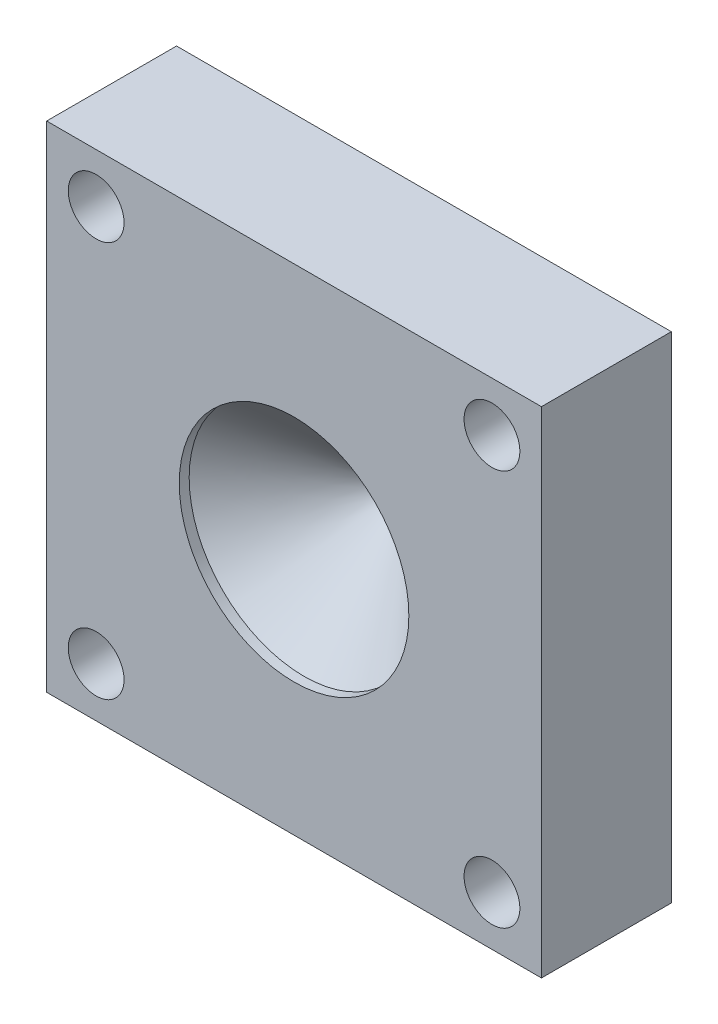
ISO-10303-21;
HEADER;
FILE_DESCRIPTION(('STEP AP214'),'2;1');
FILE_NAME('part.step','',(''),(''),'','','');
FILE_SCHEMA(('AUTOMOTIVE_DESIGN { 1 0 10303 214 1 1 1 1 }'));
ENDSEC;
DATA;
#1=APPLICATION_CONTEXT('core data for automotive mechanical design processes');
#2=APPLICATION_PROTOCOL_DEFINITION('international standard','automotive_design',2000,#1);
#3=PRODUCT_CONTEXT('',#1,'mechanical');
#4=PRODUCT('Part','Part','',(#3));
#5=PRODUCT_RELATED_PRODUCT_CATEGORY('part','',(#4));
#6=PRODUCT_DEFINITION_FORMATION('','',#4);
#7=PRODUCT_DEFINITION_CONTEXT('part definition',#1,'design');
#8=PRODUCT_DEFINITION('design','',#6,#7);
#9=PRODUCT_DEFINITION_SHAPE('','',#8);
#10=(LENGTH_UNIT() NAMED_UNIT(*) SI_UNIT(.MILLI.,.METRE.));
#11=(NAMED_UNIT(*) PLANE_ANGLE_UNIT() SI_UNIT($,.RADIAN.));
#12=(NAMED_UNIT(*) SI_UNIT($,.STERADIAN.) SOLID_ANGLE_UNIT());
#13=UNCERTAINTY_MEASURE_WITH_UNIT(LENGTH_MEASURE(1.E-05),#10,'distance_accuracy_value','');
#14=(GEOMETRIC_REPRESENTATION_CONTEXT(3) GLOBAL_UNCERTAINTY_ASSIGNED_CONTEXT((#13)) GLOBAL_UNIT_ASSIGNED_CONTEXT((#10,
#11,#12)) REPRESENTATION_CONTEXT('',''));
#15=CARTESIAN_POINT('',(0.,0.,0.));
#16=DIRECTION('',(0.,0.,1.));
#17=DIRECTION('',(1.,0.,0.));
#18=AXIS2_PLACEMENT_3D('',#15,#16,#17);
#19=CARTESIAN_POINT('',(0.,0.,16.66875));
#20=DIRECTION('',(0.,0.,-1.));
#21=DIRECTION('',(-1.,0.,0.));
#22=AXIS2_PLACEMENT_3D('',#19,#20,#21);
#23=CYLINDRICAL_SURFACE('',#22,0.79375);
#24=CARTESIAN_POINT('',(0.,0.,0.));
#25=DIRECTION('',(0.,0.,1.));
#26=DIRECTION('',(1.,0.,0.));
#27=AXIS2_PLACEMENT_3D('',#24,#25,#26);
#28=CIRCLE('',#27,0.79375);
#29=CARTESIAN_POINT('',(0.79375,0.,0.));
#30=VERTEX_POINT('',#29);
#31=EDGE_CURVE('E103',#30,#30,#28,.T.);
#32=ORIENTED_EDGE('',*,*,#31,.F.);
#33=EDGE_LOOP('',(#32));
#34=FACE_BOUND('',#33,.T.);
#35=CARTESIAN_POINT('',(0.,0.,2.69875));
#36=DIRECTION('',(0.,0.,1.));
#37=DIRECTION('',(1.,0.,0.));
#38=AXIS2_PLACEMENT_3D('',#35,#36,#37);
#39=CIRCLE('',#38,0.79375);
#40=CARTESIAN_POINT('',(0.79375,0.,2.69875));
#41=VERTEX_POINT('',#40);
#42=EDGE_CURVE('E37',#41,#41,#39,.T.);
#43=ORIENTED_EDGE('',*,*,#42,.T.);
#44=EDGE_LOOP('',(#43));
#45=FACE_BOUND('',#44,.T.);
#46=ADVANCED_FACE('F33',(#34,#45),#23,.F.);
#47=CARTESIAN_POINT('',(0.,0.,16.66875));
#48=DIRECTION('',(0.,0.,1.));
#49=DIRECTION('',(1.,0.,0.));
#50=AXIS2_PLACEMENT_3D('',#47,#48,#49);
#51=PLANE('',#50);
#52=CARTESIAN_POINT('',(0.,0.,16.66875));
#53=DIRECTION('',(0.,0.,1.));
#54=DIRECTION('',(1.,0.,0.));
#55=AXIS2_PLACEMENT_3D('',#52,#53,#54);
#56=CIRCLE('',#55,14.732);
#57=CARTESIAN_POINT('',(14.732,0.,16.66875));
#58=VERTEX_POINT('',#57);
#59=EDGE_CURVE('E139',#58,#58,#56,.T.);
#60=ORIENTED_EDGE('',*,*,#59,.F.);
#61=EDGE_LOOP('',(#60));
#62=FACE_BOUND('',#61,.T.);
#63=CARTESIAN_POINT('',(25.4000000000014,-25.3999999999986,16.66875));
#64=DIRECTION('',(0.,0.,1.));
#65=DIRECTION('',(1.,0.,0.));
#66=AXIS2_PLACEMENT_3D('',#63,#64,#65);
#67=CIRCLE('',#66,3.58140000000201);
#68=CARTESIAN_POINT('',(28.9814000000035,-25.3999999999986,16.66875));
#69=VERTEX_POINT('',#68);
#70=EDGE_CURVE('E127',#69,#69,#67,.T.);
#71=ORIENTED_EDGE('',*,*,#70,.F.);
#72=EDGE_LOOP('',(#71));
#73=FACE_BOUND('',#72,.T.);
#74=CARTESIAN_POINT('',(-25.4,25.4,16.66875));
#75=DIRECTION('',(0.,0.,1.));
#76=DIRECTION('',(1.,0.,0.));
#77=AXIS2_PLACEMENT_3D('',#74,#75,#76);
#78=CIRCLE('',#77,3.5814);
#79=CARTESIAN_POINT('',(-21.8186,25.4,16.66875));
#80=VERTEX_POINT('',#79);
#81=EDGE_CURVE('E117',#80,#80,#78,.T.);
#82=ORIENTED_EDGE('',*,*,#81,.F.);
#83=EDGE_LOOP('',(#82));
#84=FACE_BOUND('',#83,.T.);
#85=DIRECTION('',(0.,-1.,0.));
#86=VECTOR('',#85,1.);
#87=CARTESIAN_POINT('',(-31.75,-31.75,16.66875));
#88=LINE('',#87,#86);
#89=CARTESIAN_POINT('',(-31.75,31.75,16.66875));
#90=VERTEX_POINT('',#89);
#91=CARTESIAN_POINT('',(-31.75,-31.75,16.66875));
#92=VERTEX_POINT('',#91);
#93=EDGE_CURVE('E87',#90,#92,#88,.T.);
#94=ORIENTED_EDGE('',*,*,#93,.T.);
#95=DIRECTION('',(1.,0.,0.));
#96=VECTOR('',#95,1.);
#97=CARTESIAN_POINT('',(31.75,-31.75,16.66875));
#98=LINE('',#97,#96);
#99=CARTESIAN_POINT('',(31.75,-31.75,16.66875));
#100=VERTEX_POINT('',#99);
#101=EDGE_CURVE('E81',#92,#100,#98,.T.);
#102=ORIENTED_EDGE('',*,*,#101,.T.);
#103=DIRECTION('',(0.,1.,0.));
#104=VECTOR('',#103,1.);
#105=CARTESIAN_POINT('',(31.75,-31.75,16.66875));
#106=LINE('',#105,#104);
#107=CARTESIAN_POINT('',(31.75,31.75,16.66875));
#108=VERTEX_POINT('',#107);
#109=EDGE_CURVE('E85',#100,#108,#106,.T.);
#110=ORIENTED_EDGE('',*,*,#109,.T.);
#111=DIRECTION('',(-1.,0.,0.));
#112=VECTOR('',#111,1.);
#113=CARTESIAN_POINT('',(31.75,31.75,16.66875));
#114=LINE('',#113,#112);
#115=EDGE_CURVE('E51',#108,#90,#114,.T.);
#116=ORIENTED_EDGE('',*,*,#115,.T.);
#117=EDGE_LOOP('',(#94,#102,#110,#116));
#118=FACE_BOUND('',#117,.T.);
#119=CARTESIAN_POINT('',(25.4,25.4000000000014,16.66875));
#120=DIRECTION('',(0.,0.,1.));
#121=DIRECTION('',(1.,0.,0.));
#122=AXIS2_PLACEMENT_3D('',#119,#120,#121);
#123=CIRCLE('',#122,3.58140000000148);
#124=CARTESIAN_POINT('',(28.9814000000015,25.4000000000014,16.66875));
#125=VERTEX_POINT('',#124);
#126=EDGE_CURVE('E121',#125,#125,#123,.T.);
#127=ORIENTED_EDGE('',*,*,#126,.F.);
#128=EDGE_LOOP('',(#127));
#129=FACE_BOUND('',#128,.T.);
#130=CARTESIAN_POINT('',(-25.3999999999986,-25.4,16.66875));
#131=DIRECTION('',(0.,0.,1.));
#132=DIRECTION('',(1.,0.,0.));
#133=AXIS2_PLACEMENT_3D('',#130,#131,#132);
#134=CIRCLE('',#133,3.58140000000076);
#135=CARTESIAN_POINT('',(-21.8185999999978,-25.4,16.66875));
#136=VERTEX_POINT('',#135);
#137=EDGE_CURVE('E133',#136,#136,#134,.T.);
#138=ORIENTED_EDGE('',*,*,#137,.F.);
#139=EDGE_LOOP('',(#138));
#140=FACE_BOUND('',#139,.T.);
#141=ADVANCED_FACE('F82',(#62,#73,#84,#118,#129,#140),#51,.T.);
#142=CARTESIAN_POINT('',(0.,0.,0.));
#143=DIRECTION('',(0.,0.,1.));
#144=DIRECTION('',(1.,0.,0.));
#145=AXIS2_PLACEMENT_3D('',#142,#143,#144);
#146=PLANE('',#145);
#147=DIRECTION('',(0.,-1.,0.));
#148=VECTOR('',#147,1.);
#149=CARTESIAN_POINT('',(-31.75,-31.75,0.));
#150=LINE('',#149,#148);
#151=CARTESIAN_POINT('',(-31.75,31.75,0.));
#152=VERTEX_POINT('',#151);
#153=CARTESIAN_POINT('',(-31.75,-31.75,0.));
#154=VERTEX_POINT('',#153);
#155=EDGE_CURVE('E100',#152,#154,#150,.T.);
#156=ORIENTED_EDGE('',*,*,#155,.F.);
#157=DIRECTION('',(-1.,0.,0.));
#158=VECTOR('',#157,1.);
#159=CARTESIAN_POINT('',(31.75,31.75,0.));
#160=LINE('',#159,#158);
#161=CARTESIAN_POINT('',(31.75,31.75,0.));
#162=VERTEX_POINT('',#161);
#163=EDGE_CURVE('E74',#162,#152,#160,.T.);
#164=ORIENTED_EDGE('',*,*,#163,.F.);
#165=DIRECTION('',(0.,1.,0.));
#166=VECTOR('',#165,1.);
#167=CARTESIAN_POINT('',(31.75,-31.75,0.));
#168=LINE('',#167,#166);
#169=CARTESIAN_POINT('',(31.75,-31.75,0.));
#170=VERTEX_POINT('',#169);
#171=EDGE_CURVE('E68',#170,#162,#168,.T.);
#172=ORIENTED_EDGE('',*,*,#171,.F.);
#173=DIRECTION('',(1.,0.,0.));
#174=VECTOR('',#173,1.);
#175=CARTESIAN_POINT('',(31.75,-31.75,0.));
#176=LINE('',#175,#174);
#177=EDGE_CURVE('E91',#154,#170,#176,.T.);
#178=ORIENTED_EDGE('',*,*,#177,.F.);
#179=EDGE_LOOP('',(#156,#164,#172,#178));
#180=FACE_BOUND('',#179,.T.);
#181=ORIENTED_EDGE('',*,*,#31,.T.);
#182=EDGE_LOOP('',(#181));
#183=FACE_BOUND('',#182,.T.);
#184=CARTESIAN_POINT('',(-25.4,25.4,0.));
#185=DIRECTION('',(0.,0.,1.));
#186=DIRECTION('',(1.,0.,0.));
#187=AXIS2_PLACEMENT_3D('',#184,#185,#186);
#188=CIRCLE('',#187,3.5814);
#189=CARTESIAN_POINT('',(-21.8186,25.4,0.));
#190=VERTEX_POINT('',#189);
#191=EDGE_CURVE('E118',#190,#190,#188,.T.);
#192=ORIENTED_EDGE('',*,*,#191,.T.);
#193=EDGE_LOOP('',(#192));
#194=FACE_BOUND('',#193,.T.);
#195=CARTESIAN_POINT('',(25.4,25.4000000000014,0.));
#196=DIRECTION('',(0.,0.,1.));
#197=DIRECTION('',(1.,0.,0.));
#198=AXIS2_PLACEMENT_3D('',#195,#196,#197);
#199=CIRCLE('',#198,3.58140000000148);
#200=CARTESIAN_POINT('',(28.9814000000015,25.4000000000014,0.));
#201=VERTEX_POINT('',#200);
#202=EDGE_CURVE('E124',#201,#201,#199,.T.);
#203=ORIENTED_EDGE('',*,*,#202,.T.);
#204=EDGE_LOOP('',(#203));
#205=FACE_BOUND('',#204,.T.);
#206=CARTESIAN_POINT('',(25.4000000000014,-25.3999999999986,0.));
#207=DIRECTION('',(0.,0.,1.));
#208=DIRECTION('',(1.,0.,0.));
#209=AXIS2_PLACEMENT_3D('',#206,#207,#208);
#210=CIRCLE('',#209,3.58140000000201);
#211=CARTESIAN_POINT('',(28.9814000000035,-25.3999999999986,0.));
#212=VERTEX_POINT('',#211);
#213=EDGE_CURVE('E130',#212,#212,#210,.T.);
#214=ORIENTED_EDGE('',*,*,#213,.T.);
#215=EDGE_LOOP('',(#214));
#216=FACE_BOUND('',#215,.T.);
#217=CARTESIAN_POINT('',(-25.3999999999986,-25.4,0.));
#218=DIRECTION('',(0.,0.,1.));
#219=DIRECTION('',(1.,0.,0.));
#220=AXIS2_PLACEMENT_3D('',#217,#218,#219);
#221=CIRCLE('',#220,3.58140000000076);
#222=CARTESIAN_POINT('',(-21.8185999999978,-25.4,0.));
#223=VERTEX_POINT('',#222);
#224=EDGE_CURVE('E136',#223,#223,#221,.T.);
#225=ORIENTED_EDGE('',*,*,#224,.T.);
#226=EDGE_LOOP('',(#225));
#227=FACE_BOUND('',#226,.T.);
#228=ADVANCED_FACE('F111',(#180,#183,#194,#205,#216,#227),#146,.F.);
#229=CARTESIAN_POINT('',(-31.75,-31.75,16.66875));
#230=DIRECTION('',(1.,0.,0.));
#231=DIRECTION('',(0.,0.,-1.));
#232=AXIS2_PLACEMENT_3D('',#229,#230,#231);
#233=PLANE('',#232);
#234=CARTESIAN_POINT('',(-31.75,11.1125,8.25207385486948));
#235=DIRECTION('',(-1.,0.,0.));
#236=DIRECTION('',(0.,0.,1.));
#237=AXIS2_PLACEMENT_3D('',#234,#235,#236);
#238=CIRCLE('',#237,4.82746758069458);
#239=CARTESIAN_POINT('',(-31.75,11.1125,13.0795414355641));
#240=VERTEX_POINT('',#239);
#241=EDGE_CURVE('E157',#240,#240,#238,.T.);
#242=ORIENTED_EDGE('',*,*,#241,.F.);
#243=EDGE_LOOP('',(#242));
#244=FACE_BOUND('',#243,.T.);
#245=CARTESIAN_POINT('',(-31.75,0.,8.25207385486948));
#246=DIRECTION('',(-1.,0.,0.));
#247=DIRECTION('',(0.,0.,1.));
#248=AXIS2_PLACEMENT_3D('',#245,#246,#247);
#249=CIRCLE('',#248,3.15405372732174);
#250=CARTESIAN_POINT('',(-31.75,0.,11.4061275821912));
#251=VERTEX_POINT('',#250);
#252=EDGE_CURVE('E151',#251,#251,#249,.T.);
#253=ORIENTED_EDGE('',*,*,#252,.F.);
#254=EDGE_LOOP('',(#253));
#255=FACE_BOUND('',#254,.T.);
#256=CARTESIAN_POINT('',(-31.75,-11.1125,8.25207385486948));
#257=DIRECTION('',(-1.,0.,0.));
#258=DIRECTION('',(0.,0.,1.));
#259=AXIS2_PLACEMENT_3D('',#256,#257,#258);
#260=CIRCLE('',#259,4.49375698612663);
#261=CARTESIAN_POINT('',(-31.75,-11.1125,12.7458308409961));
#262=VERTEX_POINT('',#261);
#263=EDGE_CURVE('E145',#262,#262,#260,.T.);
#264=ORIENTED_EDGE('',*,*,#263,.F.);
#265=EDGE_LOOP('',(#264));
#266=FACE_BOUND('',#265,.T.);
#267=ORIENTED_EDGE('',*,*,#155,.T.);
#268=DIRECTION('',(0.,0.,-1.));
#269=VECTOR('',#268,1.);
#270=CARTESIAN_POINT('',(-31.75,-31.75,16.66875));
#271=LINE('',#270,#269);
#272=EDGE_CURVE('E11',#92,#154,#271,.T.);
#273=ORIENTED_EDGE('',*,*,#272,.F.);
#274=ORIENTED_EDGE('',*,*,#93,.F.);
#275=DIRECTION('',(0.,0.,-1.));
#276=VECTOR('',#275,1.);
#277=CARTESIAN_POINT('',(-31.75,31.75,16.66875));
#278=LINE('',#277,#276);
#279=EDGE_CURVE('E96',#90,#152,#278,.T.);
#280=ORIENTED_EDGE('',*,*,#279,.T.);
#281=EDGE_LOOP('',(#267,#273,#274,#280));
#282=FACE_BOUND('',#281,.T.);
#283=ADVANCED_FACE('F35',(#244,#255,#266,#282),#233,.F.);
#284=CARTESIAN_POINT('',(31.75,-31.75,16.66875));
#285=DIRECTION('',(0.,1.,0.));
#286=DIRECTION('',(-1.,0.,0.));
#287=AXIS2_PLACEMENT_3D('',#284,#285,#286);
#288=PLANE('',#287);
#289=ORIENTED_EDGE('',*,*,#177,.T.);
#290=DIRECTION('',(0.,0.,-1.));
#291=VECTOR('',#290,1.);
#292=CARTESIAN_POINT('',(31.75,-31.75,16.66875));
#293=LINE('',#292,#291);
#294=EDGE_CURVE('E43',#100,#170,#293,.T.);
#295=ORIENTED_EDGE('',*,*,#294,.F.);
#296=ORIENTED_EDGE('',*,*,#101,.F.);
#297=ORIENTED_EDGE('',*,*,#272,.T.);
#298=EDGE_LOOP('',(#289,#295,#296,#297));
#299=FACE_BOUND('',#298,.T.);
#300=ADVANCED_FACE('F90',(#299),#288,.F.);
#301=CARTESIAN_POINT('',(31.75,-31.75,16.66875));
#302=DIRECTION('',(-1.,0.,0.));
#303=DIRECTION('',(0.,0.,1.));
#304=AXIS2_PLACEMENT_3D('',#301,#302,#303);
#305=PLANE('',#304);
#306=ORIENTED_EDGE('',*,*,#171,.T.);
#307=DIRECTION('',(0.,0.,-1.));
#308=VECTOR('',#307,1.);
#309=CARTESIAN_POINT('',(31.75,31.75,16.66875));
#310=LINE('',#309,#308);
#311=EDGE_CURVE('E92',#108,#162,#310,.T.);
#312=ORIENTED_EDGE('',*,*,#311,.F.);
#313=ORIENTED_EDGE('',*,*,#109,.F.);
#314=ORIENTED_EDGE('',*,*,#294,.T.);
#315=EDGE_LOOP('',(#306,#312,#313,#314));
#316=FACE_BOUND('',#315,.T.);
#317=ADVANCED_FACE('F94',(#316),#305,.F.);
#318=CARTESIAN_POINT('',(31.75,31.75,16.66875));
#319=DIRECTION('',(0.,-1.,0.));
#320=DIRECTION('',(1.,0.,0.));
#321=AXIS2_PLACEMENT_3D('',#318,#319,#320);
#322=PLANE('',#321);
#323=ORIENTED_EDGE('',*,*,#163,.T.);
#324=ORIENTED_EDGE('',*,*,#279,.F.);
#325=ORIENTED_EDGE('',*,*,#115,.F.);
#326=ORIENTED_EDGE('',*,*,#311,.T.);
#327=EDGE_LOOP('',(#323,#324,#325,#326));
#328=FACE_BOUND('',#327,.T.);
#329=ADVANCED_FACE('F108',(#328),#322,.F.);
#330=CARTESIAN_POINT('',(-25.4,25.4,16.66875));
#331=DIRECTION('',(0.,0.,-1.));
#332=DIRECTION('',(-1.,0.,0.));
#333=AXIS2_PLACEMENT_3D('',#330,#331,#332);
#334=CYLINDRICAL_SURFACE('',#333,3.5814);
#335=ORIENTED_EDGE('',*,*,#81,.T.);
#336=EDGE_LOOP('',(#335));
#337=FACE_BOUND('',#336,.T.);
#338=ORIENTED_EDGE('',*,*,#191,.F.);
#339=EDGE_LOOP('',(#338));
#340=FACE_BOUND('',#339,.T.);
#341=ADVANCED_FACE('F186',(#337,#340),#334,.F.);
#342=CARTESIAN_POINT('',(25.4,25.4000000000014,16.66875));
#343=DIRECTION('',(0.,0.,-1.));
#344=DIRECTION('',(-1.,0.,0.));
#345=AXIS2_PLACEMENT_3D('',#342,#343,#344);
#346=CYLINDRICAL_SURFACE('',#345,3.58140000000148);
#347=ORIENTED_EDGE('',*,*,#126,.T.);
#348=EDGE_LOOP('',(#347));
#349=FACE_BOUND('',#348,.T.);
#350=ORIENTED_EDGE('',*,*,#202,.F.);
#351=EDGE_LOOP('',(#350));
#352=FACE_BOUND('',#351,.T.);
#353=ADVANCED_FACE('F189',(#349,#352),#346,.F.);
#354=CARTESIAN_POINT('',(25.4000000000014,-25.3999999999986,16.66875));
#355=DIRECTION('',(0.,0.,-1.));
#356=DIRECTION('',(-1.,0.,0.));
#357=AXIS2_PLACEMENT_3D('',#354,#355,#356);
#358=CYLINDRICAL_SURFACE('',#357,3.58140000000201);
#359=ORIENTED_EDGE('',*,*,#70,.T.);
#360=EDGE_LOOP('',(#359));
#361=FACE_BOUND('',#360,.T.);
#362=ORIENTED_EDGE('',*,*,#213,.F.);
#363=EDGE_LOOP('',(#362));
#364=FACE_BOUND('',#363,.T.);
#365=ADVANCED_FACE('F203',(#361,#364),#358,.F.);
#366=CARTESIAN_POINT('',(-25.3999999999986,-25.4,16.66875));
#367=DIRECTION('',(0.,0.,-1.));
#368=DIRECTION('',(-1.,0.,0.));
#369=AXIS2_PLACEMENT_3D('',#366,#367,#368);
#370=CYLINDRICAL_SURFACE('',#369,3.58140000000076);
#371=ORIENTED_EDGE('',*,*,#137,.T.);
#372=EDGE_LOOP('',(#371));
#373=FACE_BOUND('',#372,.T.);
#374=ORIENTED_EDGE('',*,*,#224,.F.);
#375=EDGE_LOOP('',(#374));
#376=FACE_BOUND('',#375,.T.);
#377=ADVANCED_FACE('F175',(#373,#376),#370,.F.);
#378=CARTESIAN_POINT('',(0.,0.,15.39875));
#379=DIRECTION('',(0.,0.,1.));
#380=DIRECTION('',(1.,0.,0.));
#381=AXIS2_PLACEMENT_3D('',#378,#379,#380);
#382=CYLINDRICAL_SURFACE('',#381,14.732);
#383=CARTESIAN_POINT('',(0.,0.,15.39875));
#384=DIRECTION('',(0.,0.,1.));
#385=DIRECTION('',(1.,0.,0.));
#386=AXIS2_PLACEMENT_3D('',#383,#384,#385);
#387=CIRCLE('',#386,14.732);
#388=CARTESIAN_POINT('',(14.732,0.,15.39875));
#389=VERTEX_POINT('',#388);
#390=EDGE_CURVE('E165',#389,#389,#387,.T.);
#391=ORIENTED_EDGE('',*,*,#390,.F.);
#392=EDGE_LOOP('',(#391));
#393=FACE_BOUND('',#392,.T.);
#394=ORIENTED_EDGE('',*,*,#59,.T.);
#395=EDGE_LOOP('',(#394));
#396=FACE_BOUND('',#395,.T.);
#397=ADVANCED_FACE('F171',(#393,#396),#382,.F.);
#398=CARTESIAN_POINT('',(-19.05,-11.1125,8.25207385486948));
#399=DIRECTION('',(-1.,0.,0.));
#400=DIRECTION('',(0.,0.,1.));
#401=AXIS2_PLACEMENT_3D('',#398,#399,#400);
#402=CYLINDRICAL_SURFACE('',#401,4.49375698612663);
#403=CARTESIAN_POINT('',(-19.05,-11.1125,8.25207385486948));
#404=DIRECTION('',(-1.,0.,0.));
#405=DIRECTION('',(0.,0.,1.));
#406=AXIS2_PLACEMENT_3D('',#403,#404,#405);
#407=CIRCLE('',#406,4.49375698612663);
#408=CARTESIAN_POINT('',(-19.05,-11.1125,12.7458308409961));
#409=VERTEX_POINT('',#408);
#410=EDGE_CURVE('E148',#409,#409,#407,.T.);
#411=ORIENTED_EDGE('',*,*,#410,.F.);
#412=EDGE_LOOP('',(#411));
#413=FACE_BOUND('',#412,.T.);
#414=ORIENTED_EDGE('',*,*,#263,.T.);
#415=EDGE_LOOP('',(#414));
#416=FACE_BOUND('',#415,.T.);
#417=ADVANCED_FACE('F174',(#413,#416),#402,.F.);
#418=CARTESIAN_POINT('',(-19.05,-11.1125,8.25207385486948));
#419=DIRECTION('',(-1.,0.,0.));
#420=DIRECTION('',(0.,0.,1.));
#421=AXIS2_PLACEMENT_3D('',#418,#419,#420);
#422=PLANE('',#421);
#423=ORIENTED_EDGE('',*,*,#410,.T.);
#424=EDGE_LOOP('',(#423));
#425=FACE_BOUND('',#424,.T.);
#426=ADVANCED_FACE('F237',(#425),#422,.T.);
#427=CARTESIAN_POINT('',(-19.05,0.,8.25207385486948));
#428=DIRECTION('',(-1.,0.,0.));
#429=DIRECTION('',(0.,0.,1.));
#430=AXIS2_PLACEMENT_3D('',#427,#428,#429);
#431=CYLINDRICAL_SURFACE('',#430,3.15405372732174);
#432=CARTESIAN_POINT('',(-19.05,0.,8.25207385486948));
#433=DIRECTION('',(-1.,0.,0.));
#434=DIRECTION('',(0.,0.,1.));
#435=AXIS2_PLACEMENT_3D('',#432,#433,#434);
#436=CIRCLE('',#435,3.15405372732174);
#437=CARTESIAN_POINT('',(-19.05,0.,11.4061275821912));
#438=VERTEX_POINT('',#437);
#439=EDGE_CURVE('E154',#438,#438,#436,.T.);
#440=ORIENTED_EDGE('',*,*,#439,.F.);
#441=EDGE_LOOP('',(#440));
#442=FACE_BOUND('',#441,.T.);
#443=ORIENTED_EDGE('',*,*,#252,.T.);
#444=EDGE_LOOP('',(#443));
#445=FACE_BOUND('',#444,.T.);
#446=ADVANCED_FACE('F243',(#442,#445),#431,.F.);
#447=CARTESIAN_POINT('',(-19.05,0.,8.25207385486948));
#448=DIRECTION('',(-1.,0.,0.));
#449=DIRECTION('',(0.,0.,1.));
#450=AXIS2_PLACEMENT_3D('',#447,#448,#449);
#451=PLANE('',#450);
#452=ORIENTED_EDGE('',*,*,#439,.T.);
#453=EDGE_LOOP('',(#452));
#454=FACE_BOUND('',#453,.T.);
#455=ADVANCED_FACE('F250',(#454),#451,.T.);
#456=CARTESIAN_POINT('',(-19.05,11.1125,8.25207385486948));
#457=DIRECTION('',(-1.,0.,0.));
#458=DIRECTION('',(0.,0.,1.));
#459=AXIS2_PLACEMENT_3D('',#456,#457,#458);
#460=CYLINDRICAL_SURFACE('',#459,4.82746758069458);
#461=CARTESIAN_POINT('',(-19.05,11.1125,8.25207385486948));
#462=DIRECTION('',(-1.,0.,0.));
#463=DIRECTION('',(0.,0.,1.));
#464=AXIS2_PLACEMENT_3D('',#461,#462,#463);
#465=CIRCLE('',#464,4.82746758069458);
#466=CARTESIAN_POINT('',(-19.05,11.1125,13.0795414355641));
#467=VERTEX_POINT('',#466);
#468=EDGE_CURVE('E144',#467,#467,#465,.T.);
#469=ORIENTED_EDGE('',*,*,#468,.F.);
#470=EDGE_LOOP('',(#469));
#471=FACE_BOUND('',#470,.T.);
#472=ORIENTED_EDGE('',*,*,#241,.T.);
#473=EDGE_LOOP('',(#472));
#474=FACE_BOUND('',#473,.T.);
#475=ADVANCED_FACE('F254',(#471,#474),#460,.F.);
#476=CARTESIAN_POINT('',(-19.05,11.1125,8.25207385486948));
#477=DIRECTION('',(-1.,0.,0.));
#478=DIRECTION('',(0.,0.,1.));
#479=AXIS2_PLACEMENT_3D('',#476,#477,#478);
#480=PLANE('',#479);
#481=ORIENTED_EDGE('',*,*,#468,.T.);
#482=EDGE_LOOP('',(#481));
#483=FACE_BOUND('',#482,.T.);
#484=ADVANCED_FACE('F258',(#483),#480,.T.);
#485=CARTESIAN_POINT('',(0.,0.,15.39875));
#486=DIRECTION('',(0.,0.,1.));
#487=DIRECTION('',(1.,0.,0.));
#488=AXIS2_PLACEMENT_3D('',#485,#486,#487);
#489=CONICAL_SURFACE('',#488,14.732,0.829031394697308);
#490=CARTESIAN_POINT('',(0.,0.,2.69875));
#491=DIRECTION('',(0.,0.,1.));
#492=DIRECTION('',(1.,0.,0.));
#493=AXIS2_PLACEMENT_3D('',#490,#491,#492);
#494=CIRCLE('',#493,0.872382036420201);
#495=CARTESIAN_POINT('',(0.872382036420201,0.,2.69875));
#496=VERTEX_POINT('',#495);
#497=EDGE_CURVE('E162',#496,#496,#494,.T.);
#498=ORIENTED_EDGE('',*,*,#497,.F.);
#499=EDGE_LOOP('',(#498));
#500=FACE_BOUND('',#499,.T.);
#501=ORIENTED_EDGE('',*,*,#390,.T.);
#502=EDGE_LOOP('',(#501));
#503=FACE_BOUND('',#502,.T.);
#504=ADVANCED_FACE('F169',(#500,#503),#489,.F.);
#505=CARTESIAN_POINT('',(0.,0.,2.69875));
#506=DIRECTION('',(0.,0.,1.));
#507=DIRECTION('',(1.,0.,0.));
#508=AXIS2_PLACEMENT_3D('',#505,#506,#507);
#509=PLANE('',#508);
#510=ORIENTED_EDGE('',*,*,#42,.F.);
#511=EDGE_LOOP('',(#510));
#512=FACE_BOUND('',#511,.T.);
#513=ORIENTED_EDGE('',*,*,#497,.T.);
#514=EDGE_LOOP('',(#513));
#515=FACE_BOUND('',#514,.T.);
#516=ADVANCED_FACE('F265',(#512,#515),#509,.T.);
#517=CLOSED_SHELL('',(#46,#141,#228,#283,#300,#317,#329,#341,#353,#365,#377,#397,#417,#426,#446,
#455,#475,#484,#504,#516));
#518=MANIFOLD_SOLID_BREP('B2',#517);
#519=ADVANCED_BREP_SHAPE_REPRESENTATION('',(#18,#518),#14);
#520=SHAPE_DEFINITION_REPRESENTATION(#9,#519);
ENDSEC;
END-ISO-10303-21;
